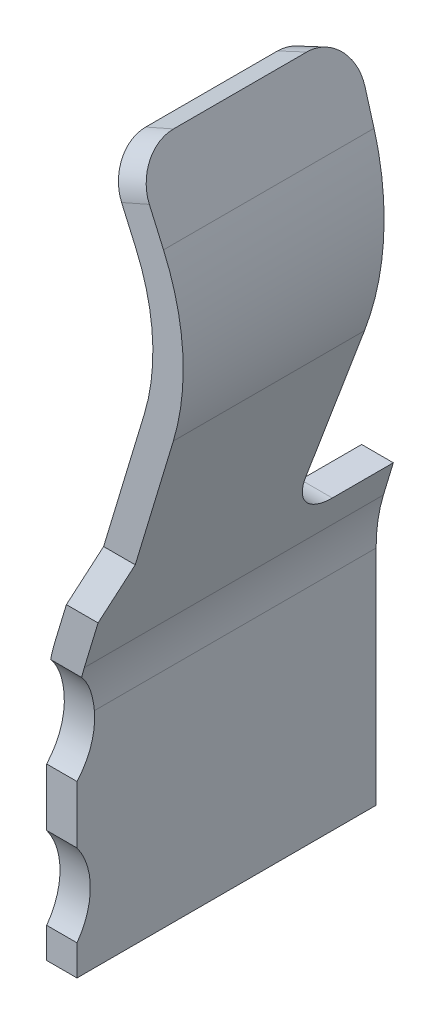
ISO-10303-21;
HEADER;
FILE_DESCRIPTION(('STEP AP214'),'2;1');
FILE_NAME('part.step','',(''),(''),'','','');
FILE_SCHEMA(('AUTOMOTIVE_DESIGN { 1 0 10303 214 1 1 1 1 }'));
ENDSEC;
DATA;
#1=APPLICATION_CONTEXT('core data for automotive mechanical design processes');
#2=APPLICATION_PROTOCOL_DEFINITION('international standard','automotive_design',2000,#1);
#3=PRODUCT_CONTEXT('',#1,'mechanical');
#4=PRODUCT('Part','Part','',(#3));
#5=PRODUCT_RELATED_PRODUCT_CATEGORY('part','',(#4));
#6=PRODUCT_DEFINITION_FORMATION('','',#4);
#7=PRODUCT_DEFINITION_CONTEXT('part definition',#1,'design');
#8=PRODUCT_DEFINITION('design','',#6,#7);
#9=PRODUCT_DEFINITION_SHAPE('','',#8);
#10=(LENGTH_UNIT() NAMED_UNIT(*) SI_UNIT(.MILLI.,.METRE.));
#11=(NAMED_UNIT(*) PLANE_ANGLE_UNIT() SI_UNIT($,.RADIAN.));
#12=(NAMED_UNIT(*) SI_UNIT($,.STERADIAN.) SOLID_ANGLE_UNIT());
#13=UNCERTAINTY_MEASURE_WITH_UNIT(LENGTH_MEASURE(1.E-05),#10,'distance_accuracy_value','');
#14=(GEOMETRIC_REPRESENTATION_CONTEXT(3) GLOBAL_UNCERTAINTY_ASSIGNED_CONTEXT((#13)) GLOBAL_UNIT_ASSIGNED_CONTEXT((#10,
#11,#12)) REPRESENTATION_CONTEXT('',''));
#15=CARTESIAN_POINT('',(0.,0.,0.));
#16=DIRECTION('',(0.,0.,1.));
#17=DIRECTION('',(1.,0.,0.));
#18=AXIS2_PLACEMENT_3D('',#15,#16,#17);
#19=CARTESIAN_POINT('',(-1.85613725867001,3.53312166947706,-0.236832722369338));
#20=DIRECTION('',(-0.914255270392898,-0.402239697454472,0.0483789866630426));
#21=DIRECTION('',(0.402711251685502,-0.915327071470027,0.));
#22=AXIS2_PLACEMENT_3D('',#19,#20,#21);
#23=CYLINDRICAL_SURFACE('',#22,0.2);
#24=CARTESIAN_POINT('',(-1.86964147732527,3.50329761180303,-0.434687053017797));
#25=CARTESIAN_POINT('',(-1.92071840447187,3.6193909515076,-0.448650066039084));
#26=CARTESIAN_POINT('',(-1.95898718351818,3.70637250294574,-0.363398989614743));
#27=CARTESIAN_POINT('',(-1.95898718351818,3.70637250294574,-0.235652283248446));
#28=(BOUNDED_CURVE() B_SPLINE_CURVE(3,(#24,#25,#26,#27),.UNSPECIFIED.,.F.,
.F.) B_SPLINE_CURVE_WITH_KNOTS((4,4),(3.0320715031167,4.71238898038462),
.UNSPECIFIED.) CURVE() GEOMETRIC_REPRESENTATION_ITEM() RATIONAL_B_SPLINE_CURVE((1.,
0.778229742533871,0.778229742533871,1.)) REPRESENTATION_ITEM(''));
#29=CARTESIAN_POINT('',(-1.86964147732527,3.50329761180303,-0.434687053017797));
#30=VERTEX_POINT('',#29);
#31=CARTESIAN_POINT('',(-1.95898718351818,3.70637250294574,-0.235652283248446));
#32=VERTEX_POINT('',#31);
#33=EDGE_CURVE('E288',#30,#32,#28,.T.);
#34=ORIENTED_EDGE('',*,*,#33,.F.);
#35=DIRECTION('',(0.914255270392898,0.402239697454473,-0.0483789866630426));
#36=VECTOR('',#35,1.);
#37=CARTESIAN_POINT('',(-25.917177596038,-7.07676024092296,0.837819069551529));
#38=LINE('',#37,#36);
#39=CARTESIAN_POINT('',(-2.00694053804578,3.44289092405021,-0.427421697659669));
#40=VERTEX_POINT('',#39);
#41=EDGE_CURVE('E11',#40,#30,#38,.T.);
#42=ORIENTED_EDGE('',*,*,#41,.F.);
#43=CARTESIAN_POINT('',(-2.09628624423868,3.64596581519291,-0.228386927890318));
#44=CARTESIAN_POINT('',(-2.09628624423869,3.64596581519291,-0.356133634256616));
#45=CARTESIAN_POINT('',(-2.05801746519237,3.55898426375477,-0.441384710680957));
#46=CARTESIAN_POINT('',(-2.00694053804578,3.44289092405021,-0.427421697659669));
#47=(BOUNDED_CURVE() B_SPLINE_CURVE(3,(#43,#44,#45,#46),.UNSPECIFIED.,.F.,
.F.) B_SPLINE_CURVE_WITH_KNOTS((4,4),(1.57079632679495,3.25111380406287),
.UNSPECIFIED.) CURVE() GEOMETRIC_REPRESENTATION_ITEM() RATIONAL_B_SPLINE_CURVE((1.,
0.778229742533869,0.778229742533869,1.)) REPRESENTATION_ITEM(''));
#48=CARTESIAN_POINT('',(-2.09628624423868,3.64596581519291,-0.228386927890318));
#49=VERTEX_POINT('',#48);
#50=EDGE_CURVE('E311',#49,#40,#47,.T.);
#51=ORIENTED_EDGE('',*,*,#50,.F.);
#52=DIRECTION('',(-0.914255270392898,-0.402239697454473,0.0483789866630426));
#53=VECTOR('',#52,1.);
#54=CARTESIAN_POINT('',(-1.93667950900712,3.71618708377106,-0.236832722369339));
#55=LINE('',#54,#53);
#56=EDGE_CURVE('E305',#32,#49,#55,.T.);
#57=ORIENTED_EDGE('',*,*,#56,.F.);
#58=EDGE_LOOP('',(#34,#42,#51,#57));
#59=FACE_BOUND('',#58,.T.);
#60=ADVANCED_FACE('F16',(#59),#23,.T.);
#61=CARTESIAN_POINT('',(-1.87844493318108,3.52330708865174,0.423604352914838));
#62=DIRECTION('',(0.915327071470027,0.402711251685503,0.));
#63=DIRECTION('',(-0.402711251685503,0.915327071470027,0.));
#64=AXIS2_PLACEMENT_3D('',#61,#62,#63);
#65=CYLINDRICAL_SURFACE('',#64,0.2);
#66=CARTESIAN_POINT('',(-2.01574399390158,3.46290040089891,0.423604352914837));
#67=DIRECTION('',(-0.915327071470027,-0.402711251685502,0.));
#68=DIRECTION('',(-0.402711251685502,0.915327071470027,0.));
#69=AXIS2_PLACEMENT_3D('',#66,#67,#68);
#70=CIRCLE('',#69,0.2);
#71=CARTESIAN_POINT('',(-2.01574399390159,3.46290040089891,0.623604352914837));
#72=VERTEX_POINT('',#71);
#73=CARTESIAN_POINT('',(-2.09628624423869,3.64596581519291,0.423604352914837));
#74=VERTEX_POINT('',#73);
#75=EDGE_CURVE('E318',#72,#74,#70,.T.);
#76=ORIENTED_EDGE('',*,*,#75,.F.);
#77=DIRECTION('',(-0.915327071470027,-0.402711251685503,0.));
#78=VECTOR('',#77,1.);
#79=CARTESIAN_POINT('',(-26.6330633966531,-7.36784176638169,0.623604352914803));
#80=LINE('',#79,#78);
#81=CARTESIAN_POINT('',(-1.87844493318108,3.52330708865174,0.623604352914837));
#82=VERTEX_POINT('',#81);
#83=EDGE_CURVE('E27',#82,#72,#80,.T.);
#84=ORIENTED_EDGE('',*,*,#83,.F.);
#85=CARTESIAN_POINT('',(-1.87844493318108,3.52330708865174,0.423604352914838));
#86=DIRECTION('',(0.915327071470028,0.402711251685501,0.));
#87=DIRECTION('',(0.402711251685501,-0.915327071470028,0.));
#88=AXIS2_PLACEMENT_3D('',#85,#86,#87);
#89=CIRCLE('',#88,0.2);
#90=CARTESIAN_POINT('',(-1.95898718351818,3.70637250294574,0.423604352914837));
#91=VERTEX_POINT('',#90);
#92=EDGE_CURVE('E271',#91,#82,#89,.T.);
#93=ORIENTED_EDGE('',*,*,#92,.F.);
#94=DIRECTION('',(0.915327071470027,0.402711251685503,0.));
#95=VECTOR('',#94,1.);
#96=CARTESIAN_POINT('',(-1.95898718351818,3.70637250294574,0.423604352914837));
#97=LINE('',#96,#95);
#98=EDGE_CURVE('E310',#74,#91,#97,.T.);
#99=ORIENTED_EDGE('',*,*,#98,.F.);
#100=EDGE_LOOP('',(#76,#84,#93,#99));
#101=FACE_BOUND('',#100,.T.);
#102=ADVANCED_FACE('F465',(#101),#65,.T.);
#103=CARTESIAN_POINT('',(-30.73,1.65634067151207,-0.212546111318104));
#104=DIRECTION('',(0.,-1.,0.));
#105=DIRECTION('',(0.,0.,-1.));
#106=AXIS2_PLACEMENT_3D('',#103,#104,#105);
#107=PLANE('',#106);
#108=DIRECTION('',(0.,0.,-1.));
#109=VECTOR('',#108,1.);
#110=CARTESIAN_POINT('',(-2.19150340910558,1.65634067151207,-0.740000000000021));
#111=LINE('',#110,#109);
#112=CARTESIAN_POINT('',(-2.19150340910558,1.65634067151207,-0.438042305987955));
#113=VERTEX_POINT('',#112);
#114=CARTESIAN_POINT('',(-2.19150340910558,1.65634067151207,-0.740000000000021));
#115=VERTEX_POINT('',#114);
#116=EDGE_CURVE('E244',#113,#115,#111,.T.);
#117=ORIENTED_EDGE('',*,*,#116,.F.);
#118=DIRECTION('',(1.,0.,0.));
#119=VECTOR('',#118,1.);
#120=CARTESIAN_POINT('',(-2.03483507894155,1.65634067151207,-0.438042305987954));
#121=LINE('',#120,#119);
#122=CARTESIAN_POINT('',(-2.03483507894154,1.65634067151207,-0.438042305987954));
#123=VERTEX_POINT('',#122);
#124=EDGE_CURVE('E245',#113,#123,#121,.T.);
#125=ORIENTED_EDGE('',*,*,#124,.T.);
#126=DIRECTION('',(0.,0.,1.));
#127=VECTOR('',#126,1.);
#128=CARTESIAN_POINT('',(-2.03483507894154,1.65634067151207,-0.74000000000002));
#129=LINE('',#128,#127);
#130=CARTESIAN_POINT('',(-2.03483507894154,1.65634067151207,-0.74000000000002));
#131=VERTEX_POINT('',#130);
#132=EDGE_CURVE('E238',#131,#123,#129,.T.);
#133=ORIENTED_EDGE('',*,*,#132,.F.);
#134=DIRECTION('',(-1.,0.,0.));
#135=VECTOR('',#134,1.);
#136=CARTESIAN_POINT('',(-1.27,1.65634067151207,-0.740000000000019));
#137=LINE('',#136,#135);
#138=EDGE_CURVE('E277',#131,#115,#137,.T.);
#139=ORIENTED_EDGE('',*,*,#138,.T.);
#140=EDGE_LOOP('',(#117,#125,#133,#139));
#141=FACE_BOUND('',#140,.T.);
#142=ADVANCED_FACE('F468',(#141),#107,.F.);
#143=CARTESIAN_POINT('',(-30.73,3.70637250294571,-0.459111687165995));
#144=DIRECTION('',(0.,0.119413416546905,0.992844618230162));
#145=DIRECTION('',(1.,0.,0.));
#146=AXIS2_PLACEMENT_3D('',#143,#144,#145);
#147=PLANE('',#146);
#148=DIRECTION('',(0.286748539926818,0.951150986717315,-0.11439875574724));
#149=VECTOR('',#148,1.);
#150=CARTESIAN_POINT('',(-2.06587763511194,1.55337185451571,-0.200161637444148));
#151=LINE('',#150,#149);
#152=CARTESIAN_POINT('',(-1.96733997726959,1.88022335482146,-0.239473382341922));
#153=VERTEX_POINT('',#152);
#154=CARTESIAN_POINT('',(-1.75979823954622,2.56864369924933,-0.322272466749581));
#155=VERTEX_POINT('',#154);
#156=EDGE_CURVE('E234',#153,#155,#151,.T.);
#157=ORIENTED_EDGE('',*,*,#156,.F.);
#158=DIRECTION('',(-1.,0.,0.));
#159=VECTOR('',#158,1.);
#160=CARTESIAN_POINT('',(-2.19150340910559,1.88022335482146,-0.239473382341922));
#161=LINE('',#160,#159);
#162=CARTESIAN_POINT('',(-2.12400830743362,1.88022335482146,-0.239473382341922));
#163=VERTEX_POINT('',#162);
#164=EDGE_CURVE('E360',#153,#163,#161,.T.);
#165=ORIENTED_EDGE('',*,*,#164,.T.);
#166=DIRECTION('',(-0.28674853992682,-0.951150986717314,0.11439875574724));
#167=VECTOR('',#166,1.);
#168=CARTESIAN_POINT('',(-2.2096639548885,1.59610175610151,-0.205300934614505));
#169=LINE('',#168,#167);
#170=CARTESIAN_POINT('',(-1.90341373590366,2.61194022573825,-0.327479914176623));
#171=VERTEX_POINT('',#170);
#172=EDGE_CURVE('E264',#171,#163,#169,.T.);
#173=ORIENTED_EDGE('',*,*,#172,.F.);
#174=CARTESIAN_POINT('',(-1.94552330681659,3.30329498734983,-0.410631932744419));
#175=CARTESIAN_POINT('',(-1.8485450102924,3.08287189317973,-0.384120760424612));
#176=CARTESIAN_POINT('',(-1.83390448882343,2.84250387207174,-0.355210731501567));
#177=CARTESIAN_POINT('',(-1.90341373590366,2.61194022573825,-0.327479914176623));
#178=(BOUNDED_CURVE() B_SPLINE_CURVE(3,(#174,#175,#176,#177),.UNSPECIFIED.,.F.,
.F.) B_SPLINE_CURVE_WITH_KNOTS((4,4),(4.29791199977039,5.00519872138853),
.UNSPECIFIED.) CURVE() GEOMETRIC_REPRESENTATION_ITEM() RATIONAL_B_SPLINE_CURVE((1.,
0.958744787021091,0.958744787021091,1.)) REPRESENTATION_ITEM(''));
#179=CARTESIAN_POINT('',(-1.94552330681659,3.30329498734983,-0.410631932744419));
#180=VERTEX_POINT('',#179);
#181=EDGE_CURVE('E373',#180,#171,#178,.T.);
#182=ORIENTED_EDGE('',*,*,#181,.F.);
#183=DIRECTION('',(0.400292818236851,-0.909830186054405,0.109428936813833));
#184=VECTOR('',#183,1.);
#185=CARTESIAN_POINT('',(-1.95995081965593,3.33608744850051,-0.414576013974334));
#186=LINE('',#185,#184);
#187=EDGE_CURVE('E317',#40,#180,#186,.T.);
#188=ORIENTED_EDGE('',*,*,#187,.F.);
#189=ORIENTED_EDGE('',*,*,#41,.T.);
#190=DIRECTION('',(-0.40029281823685,0.909830186054405,-0.109428936813833));
#191=VECTOR('',#190,1.);
#192=CARTESIAN_POINT('',(-1.82233351008822,3.39577078475993,-0.421754368938235));
#193=LINE('',#192,#191);
#194=CARTESIAN_POINT('',(-1.80822424609609,3.36370167510267,-0.417897288102547));
#195=VERTEX_POINT('',#194);
#196=EDGE_CURVE('E298',#195,#30,#193,.T.);
#197=ORIENTED_EDGE('',*,*,#196,.F.);
#198=CARTESIAN_POINT('',(-1.75979823954622,2.56864369924933,-0.322272466749581));
#199=CARTESIAN_POINT('',(-1.67986260540396,2.83379189253285,-0.354162906673267));
#200=CARTESIAN_POINT('',(-1.69669920509327,3.11021511680704,-0.387409439934769));
#201=CARTESIAN_POINT('',(-1.80822424609609,3.36370167510267,-0.417897288102547));
#202=(BOUNDED_CURVE() B_SPLINE_CURVE(3,(#198,#199,#200,#201),.UNSPECIFIED.,.F.,
.F.) B_SPLINE_CURVE_WITH_KNOTS((4,4),(1.27798658579106,1.98527330740919),
.UNSPECIFIED.) CURVE() GEOMETRIC_REPRESENTATION_ITEM() RATIONAL_B_SPLINE_CURVE((1.,
0.958744787021091,0.958744787021091,1.)) REPRESENTATION_ITEM(''));
#203=EDGE_CURVE('E398',#155,#195,#202,.T.);
#204=ORIENTED_EDGE('',*,*,#203,.F.);
#205=EDGE_LOOP('',(#157,#165,#173,#182,#188,#189,#197,#204));
#206=FACE_BOUND('',#205,.T.);
#207=ADVANCED_FACE('F491',(#206),#147,.F.);
#208=CARTESIAN_POINT('',(-30.73,1.94413292378283,0.623604352914797));
#209=DIRECTION('',(0.,0.,-1.));
#210=DIRECTION('',(0.,-1.,0.));
#211=AXIS2_PLACEMENT_3D('',#208,#209,#210);
#212=PLANE('',#211);
#213=DIRECTION('',(0.4027112516855,-0.915327071470028,0.));
#214=VECTOR('',#213,1.);
#215=CARTESIAN_POINT('',(-1.80822424609609,3.36370167510267,0.623604352914838));
#216=LINE('',#215,#214);
#217=CARTESIAN_POINT('',(-1.80822424609609,3.36370167510267,0.623604352914838));
#218=VERTEX_POINT('',#217);
#219=EDGE_CURVE('E275',#82,#218,#216,.T.);
#220=ORIENTED_EDGE('',*,*,#219,.F.);
#221=ORIENTED_EDGE('',*,*,#83,.T.);
#222=DIRECTION('',(-0.402711251685501,0.915327071470028,0.));
#223=VECTOR('',#222,1.);
#224=CARTESIAN_POINT('',(-1.94552330681659,3.30329498734984,0.623604352914837));
#225=LINE('',#224,#223);
#226=CARTESIAN_POINT('',(-1.94552330681659,3.30329498734983,0.623604352914837));
#227=VERTEX_POINT('',#226);
#228=EDGE_CURVE('E309',#227,#72,#225,.T.);
#229=ORIENTED_EDGE('',*,*,#228,.F.);
#230=CARTESIAN_POINT('',(-2.86085037828662,2.90058373566433,0.623604352914836));
#231=DIRECTION('',(0.,0.,1.));
#232=DIRECTION('',(-1.,0.,0.));
#233=AXIS2_PLACEMENT_3D('',#230,#231,#232);
#234=CIRCLE('',#233,1.);
#235=CARTESIAN_POINT('',(-1.90341373590366,2.61194022573825,0.623604352914837));
#236=VERTEX_POINT('',#235);
#237=EDGE_CURVE('E335',#236,#227,#234,.T.);
#238=ORIENTED_EDGE('',*,*,#237,.F.);
#239=DIRECTION('',(0.28864350992609,0.957436642382956,0.));
#240=VECTOR('',#239,1.);
#241=CARTESIAN_POINT('',(-2.22743664238296,1.53714937485737,0.623604352914836));
#242=LINE('',#241,#240);
#243=CARTESIAN_POINT('',(-2.10474115022836,1.94413292378283,0.623604352914837));
#244=VERTEX_POINT('',#243);
#245=EDGE_CURVE('E251',#244,#236,#242,.T.);
#246=ORIENTED_EDGE('',*,*,#245,.F.);
#247=DIRECTION('',(1.,0.,0.));
#248=VECTOR('',#247,1.);
#249=CARTESIAN_POINT('',(-30.73,1.94413292378283,0.623604352914797));
#250=LINE('',#249,#248);
#251=CARTESIAN_POINT('',(-1.94807282006433,1.94413292378283,0.623604352914837));
#252=VERTEX_POINT('',#251);
#253=EDGE_CURVE('E281',#244,#252,#250,.T.);
#254=ORIENTED_EDGE('',*,*,#253,.T.);
#255=DIRECTION('',(-0.288643509926088,-0.957436642382956,0.));
#256=VECTOR('',#255,1.);
#257=CARTESIAN_POINT('',(-2.08382114602552,1.49385284836845,0.623604352914837));
#258=LINE('',#257,#256);
#259=CARTESIAN_POINT('',(-1.75979823954622,2.56864369924933,0.623604352914837));
#260=VERTEX_POINT('',#259);
#261=EDGE_CURVE('E228',#260,#252,#258,.T.);
#262=ORIENTED_EDGE('',*,*,#261,.F.);
#263=CARTESIAN_POINT('',(-2.86085037828662,2.90058373566433,0.623604352914836));
#264=DIRECTION('',(0.,0.,-1.));
#265=DIRECTION('',(-1.,0.,0.));
#266=AXIS2_PLACEMENT_3D('',#263,#264,#265);
#267=CIRCLE('',#266,1.15);
#268=EDGE_CURVE('E325',#218,#260,#267,.T.);
#269=ORIENTED_EDGE('',*,*,#268,.F.);
#270=EDGE_LOOP('',(#220,#221,#229,#238,#246,#254,#262,#269));
#271=FACE_BOUND('',#270,.T.);
#272=ADVANCED_FACE('F622',(#271),#212,.F.);
#273=CARTESIAN_POINT('',(-30.73,1.7003498353216,0.749999999999972));
#274=DIRECTION('',(0.,-0.460287319631494,-0.887770005906065));
#275=DIRECTION('',(0.,-0.887770005906065,0.460287319631494));
#276=AXIS2_PLACEMENT_3D('',#273,#274,#275);
#277=PLANE('',#276);
#278=ORIENTED_EDGE('',*,*,#253,.F.);
#279=DIRECTION('',(0.258541028225373,0.857586072334425,-0.444637678635293));
#280=VECTOR('',#279,1.);
#281=CARTESIAN_POINT('',(-2.04642343830644,2.13757401070795,0.523309818502746));
#282=LINE('',#281,#280);
#283=CARTESIAN_POINT('',(-2.17242108767926,1.7196371362757,0.73999999999998));
#284=VERTEX_POINT('',#283);
#285=EDGE_CURVE('E256',#284,#244,#282,.T.);
#286=ORIENTED_EDGE('',*,*,#285,.F.);
#287=DIRECTION('',(-1.,0.,0.));
#288=VECTOR('',#287,1.);
#289=CARTESIAN_POINT('',(-1.27,1.7196371362757,0.739999999999981));
#290=LINE('',#289,#288);
#291=CARTESIAN_POINT('',(-2.01575275751523,1.7196371362757,0.73999999999998));
#292=VERTEX_POINT('',#291);
#293=EDGE_CURVE('E392',#292,#284,#290,.T.);
#294=ORIENTED_EDGE('',*,*,#293,.F.);
#295=DIRECTION('',(-0.258541028225372,-0.857586072334425,0.444637678635293));
#296=VECTOR('',#295,1.);
#297=CARTESIAN_POINT('',(-1.90022736191621,2.10283732290249,0.541319952677682));
#298=LINE('',#297,#296);
#299=EDGE_CURVE('E231',#252,#292,#298,.T.);
#300=ORIENTED_EDGE('',*,*,#299,.F.);
#301=EDGE_LOOP('',(#278,#286,#294,#300));
#302=FACE_BOUND('',#301,.T.);
#303=ADVANCED_FACE('F18',(#302),#277,.F.);
#304=CARTESIAN_POINT('',(-1.27,1.24850586493128,0.739999999999981));
#305=DIRECTION('',(0.,0.,-1.));
#306=DIRECTION('',(0.,-1.,0.));
#307=AXIS2_PLACEMENT_3D('',#304,#305,#306);
#308=PLANE('',#307);
#309=DIRECTION('',(0.,1.,0.));
#310=VECTOR('',#309,1.);
#311=CARTESIAN_POINT('',(-2.12,0.145965815192914,0.73999999999998));
#312=LINE('',#311,#310);
#313=CARTESIAN_POINT('',(-2.12,0.145965815192914,0.73999999999998));
#314=VERTEX_POINT('',#313);
#315=CARTESIAN_POINT('',(-2.12,0.296740599868486,0.73999999999998));
#316=VERTEX_POINT('',#315);
#317=EDGE_CURVE('E168',#314,#316,#312,.T.);
#318=ORIENTED_EDGE('',*,*,#317,.T.);
#319=DIRECTION('',(-1.,0.,0.));
#320=VECTOR('',#319,1.);
#321=CARTESIAN_POINT('',(-30.73,0.296740599868486,0.73999999999994));
#322=LINE('',#321,#320);
#323=CARTESIAN_POINT('',(-2.27,0.296740599868486,0.739999999999979));
#324=VERTEX_POINT('',#323);
#325=EDGE_CURVE('E217',#316,#324,#322,.T.);
#326=ORIENTED_EDGE('',*,*,#325,.T.);
#327=DIRECTION('',(0.,-1.,0.));
#328=VECTOR('',#327,1.);
#329=CARTESIAN_POINT('',(-2.27,0.145965815192914,0.739999999999979));
#330=LINE('',#329,#328);
#331=CARTESIAN_POINT('',(-2.27,0.145965815192914,0.739999999999979));
#332=VERTEX_POINT('',#331);
#333=EDGE_CURVE('E195',#324,#332,#330,.T.);
#334=ORIENTED_EDGE('',*,*,#333,.T.);
#335=DIRECTION('',(1.,0.,0.));
#336=VECTOR('',#335,1.);
#337=CARTESIAN_POINT('',(-2.12,0.145965815192914,0.73999999999998));
#338=LINE('',#337,#336);
#339=EDGE_CURVE('E190',#332,#314,#338,.T.);
#340=ORIENTED_EDGE('',*,*,#339,.T.);
#341=EDGE_LOOP('',(#318,#326,#334,#340));
#342=FACE_BOUND('',#341,.T.);
#343=ADVANCED_FACE('F194',(#342),#308,.F.);
#344=CARTESIAN_POINT('',(-1.27,1.24850586493128,-0.740000000000019));
#345=DIRECTION('',(0.,0.,-1.));
#346=DIRECTION('',(0.,-1.,0.));
#347=AXIS2_PLACEMENT_3D('',#344,#345,#346);
#348=PLANE('',#347);
#349=ORIENTED_EDGE('',*,*,#138,.F.);
#350=DIRECTION('',(0.288643509926088,0.957436642382956,0.));
#351=VECTOR('',#350,1.);
#352=CARTESIAN_POINT('',(-2.08382114602552,1.49385284836845,-0.74000000000002));
#353=LINE('',#352,#351);
#354=CARTESIAN_POINT('',(-2.08382114602552,1.49385284836845,-0.74000000000002));
#355=VERTEX_POINT('',#354);
#356=EDGE_CURVE('E260',#355,#131,#353,.T.);
#357=ORIENTED_EDGE('',*,*,#356,.F.);
#358=CARTESIAN_POINT('',(-1.27,1.24850586493128,-0.740000000000019));
#359=DIRECTION('',(0.,0.,-1.));
#360=DIRECTION('',(1.,0.,0.));
#361=AXIS2_PLACEMENT_3D('',#358,#359,#360);
#362=CIRCLE('',#361,0.85);
#363=CARTESIAN_POINT('',(-2.12,1.24850586493128,-0.74000000000002));
#364=VERTEX_POINT('',#363);
#365=EDGE_CURVE('E223',#364,#355,#362,.T.);
#366=ORIENTED_EDGE('',*,*,#365,.F.);
#367=DIRECTION('',(0.,1.,0.));
#368=VECTOR('',#367,1.);
#369=CARTESIAN_POINT('',(-2.12,0.145965815192914,-0.74000000000002));
#370=LINE('',#369,#368);
#371=CARTESIAN_POINT('',(-2.12,0.145965815192914,-0.74000000000002));
#372=VERTEX_POINT('',#371);
#373=EDGE_CURVE('E183',#372,#364,#370,.T.);
#374=ORIENTED_EDGE('',*,*,#373,.F.);
#375=DIRECTION('',(1.,0.,0.));
#376=VECTOR('',#375,1.);
#377=CARTESIAN_POINT('',(-2.12,0.145965815192914,-0.74000000000002));
#378=LINE('',#377,#376);
#379=CARTESIAN_POINT('',(-2.27,0.145965815192914,-0.740000000000021));
#380=VERTEX_POINT('',#379);
#381=EDGE_CURVE('E191',#380,#372,#378,.T.);
#382=ORIENTED_EDGE('',*,*,#381,.F.);
#383=DIRECTION('',(0.,-1.,0.));
#384=VECTOR('',#383,1.);
#385=CARTESIAN_POINT('',(-2.27,0.145965815192914,-0.740000000000021));
#386=LINE('',#385,#384);
#387=CARTESIAN_POINT('',(-2.27,1.24850586493128,-0.740000000000021));
#388=VERTEX_POINT('',#387);
#389=EDGE_CURVE('E42',#388,#380,#386,.T.);
#390=ORIENTED_EDGE('',*,*,#389,.F.);
#391=CARTESIAN_POINT('',(-1.27,1.24850586493128,-0.740000000000019));
#392=DIRECTION('',(0.,0.,1.));
#393=DIRECTION('',(1.,0.,0.));
#394=AXIS2_PLACEMENT_3D('',#391,#392,#393);
#395=CIRCLE('',#394,1.);
#396=CARTESIAN_POINT('',(-2.22743664238295,1.53714937485737,-0.740000000000021));
#397=VERTEX_POINT('',#396);
#398=EDGE_CURVE('E357',#397,#388,#395,.T.);
#399=ORIENTED_EDGE('',*,*,#398,.F.);
#400=DIRECTION('',(-0.28864350992609,-0.957436642382956,0.));
#401=VECTOR('',#400,1.);
#402=CARTESIAN_POINT('',(-2.22743664238295,1.53714937485737,-0.740000000000021));
#403=LINE('',#402,#401);
#404=EDGE_CURVE('E239',#115,#397,#403,.T.);
#405=ORIENTED_EDGE('',*,*,#404,.F.);
#406=EDGE_LOOP('',(#349,#357,#366,#374,#382,#390,#399,#405));
#407=FACE_BOUND('',#406,.T.);
#408=ADVANCED_FACE('F483',(#407),#348,.T.);
#409=CARTESIAN_POINT('',(-2.27,0.145965815192914,-0.740000000000021));
#410=DIRECTION('',(1.,0.,0.));
#411=DIRECTION('',(0.,1.,0.));
#412=AXIS2_PLACEMENT_3D('',#409,#410,#411);
#413=PLANE('',#412);
#414=DIRECTION('',(0.,-1.,0.));
#415=VECTOR('',#414,1.);
#416=CARTESIAN_POINT('',(-2.27,0.145965815192914,0.739999999999979));
#417=LINE('',#416,#415);
#418=CARTESIAN_POINT('',(-2.27,0.988055123608201,0.739999999999979));
#419=VERTEX_POINT('',#418);
#420=CARTESIAN_POINT('',(-2.27,0.703259400131467,0.739999999999979));
#421=VERTEX_POINT('',#420);
#422=EDGE_CURVE('E199',#419,#421,#417,.T.);
#423=ORIENTED_EDGE('',*,*,#422,.F.);
#424=CARTESIAN_POINT('',(-2.27,1.21669179396546,0.995153761033096));
#425=DIRECTION('',(1.,0.,0.));
#426=DIRECTION('',(0.,1.,0.));
#427=AXIS2_PLACEMENT_3D('',#424,#425,#426);
#428=CIRCLE('',#427,0.342604974863759);
#429=CARTESIAN_POINT('',(-2.27,1.24850586493128,0.654029100989324));
#430=VERTEX_POINT('',#429);
#431=EDGE_CURVE('E349',#419,#430,#428,.T.);
#432=ORIENTED_EDGE('',*,*,#431,.T.);
#433=DIRECTION('',(0.,0.,1.));
#434=VECTOR('',#433,1.);
#435=CARTESIAN_POINT('',(-2.27,1.24850586493128,-0.740000000000021));
#436=LINE('',#435,#434);
#437=EDGE_CURVE('E255',#388,#430,#436,.T.);
#438=ORIENTED_EDGE('',*,*,#437,.F.);
#439=ORIENTED_EDGE('',*,*,#389,.T.);
#440=DIRECTION('',(0.,0.,1.));
#441=VECTOR('',#440,1.);
#442=CARTESIAN_POINT('',(-2.27,0.145965815192914,-0.740000000000021));
#443=LINE('',#442,#441);
#444=EDGE_CURVE('E198',#380,#332,#443,.T.);
#445=ORIENTED_EDGE('',*,*,#444,.T.);
#446=ORIENTED_EDGE('',*,*,#333,.F.);
#447=CARTESIAN_POINT('',(-2.27,0.499999999999977,1.0194268345702));
#448=DIRECTION('',(1.,0.,0.));
#449=DIRECTION('',(0.,1.,0.));
#450=AXIS2_PLACEMENT_3D('',#447,#448,#449);
#451=CIRCLE('',#450,0.345533991988848);
#452=EDGE_CURVE('E214',#324,#421,#451,.T.);
#453=ORIENTED_EDGE('',*,*,#452,.T.);
#454=EDGE_LOOP('',(#423,#432,#438,#439,#445,#446,#453));
#455=FACE_BOUND('',#454,.T.);
#456=ADVANCED_FACE('F451',(#455),#413,.F.);
#457=CARTESIAN_POINT('',(-1.27,1.24850586493128,-0.740000000000019));
#458=DIRECTION('',(0.,0.,1.));
#459=DIRECTION('',(-1.,0.,0.));
#460=AXIS2_PLACEMENT_3D('',#457,#458,#459);
#461=CYLINDRICAL_SURFACE('',#460,1.);
#462=ORIENTED_EDGE('',*,*,#437,.T.);
#463=CARTESIAN_POINT('',(-2.27,1.24850586493127,0.654029100989324));
#464=CARTESIAN_POINT('',(-2.27000007407363,1.25306932177748,0.654454497923835));
#465=CARTESIAN_POINT('',(-2.26996876472137,1.25762446546712,0.654969794425774));
#466=CARTESIAN_POINT('',(-2.26984483490432,1.26669234380872,0.656178662703507));
#467=CARTESIAN_POINT('',(-2.26975245079703,1.27120517419842,0.656871540938563));
#468=CARTESIAN_POINT('',(-2.26950808670678,1.28018764830056,0.658435530000101));
#469=CARTESIAN_POINT('',(-2.26935624289613,1.28465736694881,0.659306231418194));
#470=CARTESIAN_POINT('',(-2.26899477703104,1.29355289226453,0.661225514697385));
#471=CARTESIAN_POINT('',(-2.2687851944591,1.29797872680563,0.66227397481712));
#472=CARTESIAN_POINT('',(-2.26831002792707,1.30678583476397,0.664548502475786));
#473=CARTESIAN_POINT('',(-2.26804439252603,1.31116706334694,0.665774732832754));
#474=CARTESIAN_POINT('',(-2.26745889152881,1.31988437499395,0.668404514864849));
#475=CARTESIAN_POINT('',(-2.26713889099457,1.32422031651338,0.669808505488944));
#476=CARTESIAN_POINT('',(-2.26644641069623,1.33284654509273,0.672793524574298));
#477=CARTESIAN_POINT('',(-2.26607372137307,1.33713657245114,0.67437525453736));
#478=CARTESIAN_POINT('',(-2.26527760241854,1.34567049059148,0.677715533217567));
#479=CARTESIAN_POINT('',(-2.26485389867301,1.34991398511754,0.679475028174295));
#480=CARTESIAN_POINT('',(-2.26396321849389,1.35830019523904,0.683146652073494));
#481=CARTESIAN_POINT('',(-2.26349650719558,1.36244335249443,0.685057836907499));
#482=CARTESIAN_POINT('',(-2.26252312860201,1.37063194178074,0.6890335315101));
#483=CARTESIAN_POINT('',(-2.26201661211662,1.3746776733665,0.691097460992356));
#484=CARTESIAN_POINT('',(-2.26096713168236,1.38267128376232,0.695378434355305));
#485=CARTESIAN_POINT('',(-2.26042424735263,1.3866193519919,0.69759514404689));
#486=CARTESIAN_POINT('',(-2.25930544298223,1.39441764648526,0.702181418874191));
#487=CARTESIAN_POINT('',(-2.25872954299439,1.39826793013232,0.704550891332612));
#488=CARTESIAN_POINT('',(-2.25754802962805,1.40587073759695,0.709442454924467));
#489=CARTESIAN_POINT('',(-2.25694238918284,1.40962316741917,0.711964685588729));
#490=CARTESIAN_POINT('',(-2.25570462073635,1.4170304504751,0.717161525963165));
#491=CARTESIAN_POINT('',(-2.25507243147301,1.42068504210779,0.719836493879691));
#492=CARTESIAN_POINT('',(-2.25378470654221,1.42789683764576,0.725338623347788));
#493=CARTESIAN_POINT('',(-2.25312908847075,1.43145359950846,0.728166344681211));
#494=CARTESIAN_POINT('',(-2.25179751594577,1.43847023752972,0.733973670299352));
#495=CARTESIAN_POINT('',(-2.25112147050097,1.44192948379825,0.736954014976151));
#496=CARTESIAN_POINT('',(-2.25043911813473,1.44532846432271,0.73999999999998));
#497=B_SPLINE_CURVE_WITH_KNOTS('',3,(#463,#464,#465,#466,#467,#468,#469,#470,#471,#472,#473,
#474,#475,#476,#477,#478,#479,#480,#481,#482,#483,#484,#485,#486,#487,#488,#489,#490,#491,#492,
#493,#494,#495,#496),.UNSPECIFIED.,.F.,.F.,(4,2,2,2,2,2,2,2,2,2,2,2,2,2,2,2,4),(0.,
0.013748827736232,0.0274447569667543,0.0411095020469267,0.0547649260984996,0.0684329369744623,
0.0821353821572885,0.0958939450956067,0.109730045405059,0.123485924962941,0.137191991355335,
0.150868974599205,0.164537737053089,0.17821917870054,0.191934141578145,0.205703315519925,
0.219547147320743),.UNSPECIFIED.);
#498=CARTESIAN_POINT('',(-2.25043911813473,1.44532846432271,0.739999999999979));
#499=VERTEX_POINT('',#498);
#500=EDGE_CURVE('E218',#430,#499,#497,.T.);
#501=ORIENTED_EDGE('',*,*,#500,.T.);
#502=CARTESIAN_POINT('',(-1.27,1.24850586493128,0.739999999999981));
#503=DIRECTION('',(0.,0.,1.));
#504=DIRECTION('',(1.,0.,0.));
#505=AXIS2_PLACEMENT_3D('',#502,#503,#504);
#506=CIRCLE('',#505,1.);
#507=CARTESIAN_POINT('',(-2.22743664238295,1.53714937485737,0.739999999999979));
#508=VERTEX_POINT('',#507);
#509=EDGE_CURVE('E405',#508,#499,#506,.T.);
#510=ORIENTED_EDGE('',*,*,#509,.F.);
#511=DIRECTION('',(0.,0.,1.));
#512=VECTOR('',#511,1.);
#513=CARTESIAN_POINT('',(-2.22743664238295,1.53714937485737,-0.740000000000021));
#514=LINE('',#513,#512);
#515=EDGE_CURVE('E243',#397,#508,#514,.T.);
#516=ORIENTED_EDGE('',*,*,#515,.F.);
#517=ORIENTED_EDGE('',*,*,#398,.T.);
#518=EDGE_LOOP('',(#462,#501,#510,#516,#517));
#519=FACE_BOUND('',#518,.T.);
#520=ADVANCED_FACE('F440',(#519),#461,.T.);
#521=CARTESIAN_POINT('',(-2.22743664238295,1.53714937485737,-0.740000000000021));
#522=DIRECTION('',(0.957436642382956,-0.28864350992609,0.));
#523=DIRECTION('',(0.,0.,-1.));
#524=AXIS2_PLACEMENT_3D('',#521,#522,#523);
#525=PLANE('',#524);
#526=ORIENTED_EDGE('',*,*,#172,.T.);
#527=CARTESIAN_POINT('',(-2.12400830743362,1.88022335482146,-0.239473382341922));
#528=CARTESIAN_POINT('',(-2.12639827429865,1.87229578405696,-0.238519901512672));
#529=CARTESIAN_POINT('',(-2.12880115558452,1.86432537588468,-0.238042305987954));
#530=CARTESIAN_POINT('',(-2.13120834682183,1.85634067151208,-0.238042305987954));
#531=(BOUNDED_CURVE() B_SPLINE_CURVE(3,(#527,#528,#529,#530),.UNSPECIFIED.,.F.,
.F.) B_SPLINE_CURVE_WITH_KNOTS((4,4),(4.59268992994791,4.71238898038469),
.UNSPECIFIED.) CURVE() GEOMETRIC_REPRESENTATION_ITEM() RATIONAL_B_SPLINE_CURVE((1.,
0.998806367803328,0.998806367803328,1.)) REPRESENTATION_ITEM(''));
#532=CARTESIAN_POINT('',(-2.13120834682183,1.85634067151208,-0.238042305987954));
#533=VERTEX_POINT('',#532);
#534=EDGE_CURVE('E287',#163,#533,#531,.T.);
#535=ORIENTED_EDGE('',*,*,#534,.T.);
#536=CARTESIAN_POINT('',(-2.13120834682183,1.85634067151208,-0.238042305987954));
#537=CARTESIAN_POINT('',(-2.16652837656352,1.73918338398669,-0.238042305987954));
#538=CARTESIAN_POINT('',(-2.19150340910557,1.65634067151208,-0.320885018462573));
#539=CARTESIAN_POINT('',(-2.19150340910558,1.65634067151207,-0.438042305987955));
#540=(BOUNDED_CURVE() B_SPLINE_CURVE(3,(#536,#537,#538,#539),.UNSPECIFIED.,.F.,
.F.) B_SPLINE_CURVE_WITH_KNOTS((4,4),(4.71238898038469,6.28318530717959),
.UNSPECIFIED.) CURVE() GEOMETRIC_REPRESENTATION_ITEM() RATIONAL_B_SPLINE_CURVE((1.,
0.804737854124365,0.804737854124365,1.)) REPRESENTATION_ITEM(''));
#541=EDGE_CURVE('E249',#533,#113,#540,.T.);
#542=ORIENTED_EDGE('',*,*,#541,.T.);
#543=ORIENTED_EDGE('',*,*,#116,.T.);
#544=ORIENTED_EDGE('',*,*,#404,.T.);
#545=ORIENTED_EDGE('',*,*,#515,.T.);
#546=DIRECTION('',(-0.28864350992609,-0.957436642382956,0.));
#547=VECTOR('',#546,1.);
#548=CARTESIAN_POINT('',(-2.22743664238296,1.53714937485737,0.739999999999979));
#549=LINE('',#548,#547);
#550=EDGE_CURVE('E401',#284,#508,#549,.T.);
#551=ORIENTED_EDGE('',*,*,#550,.F.);
#552=ORIENTED_EDGE('',*,*,#285,.T.);
#553=ORIENTED_EDGE('',*,*,#245,.T.);
#554=DIRECTION('',(0.,0.,1.));
#555=VECTOR('',#554,1.);
#556=CARTESIAN_POINT('',(-1.90341373590366,2.61194022573825,-0.74000000000002));
#557=LINE('',#556,#555);
#558=EDGE_CURVE('E341',#171,#236,#557,.T.);
#559=ORIENTED_EDGE('',*,*,#558,.F.);
#560=EDGE_LOOP('',(#526,#535,#542,#543,#544,#545,#551,#552,#553,#559));
#561=FACE_BOUND('',#560,.T.);
#562=ADVANCED_FACE('F450',(#561),#525,.F.);
#563=CARTESIAN_POINT('',(-2.86085037828662,2.90058373566433,-0.740000000000021));
#564=DIRECTION('',(0.,0.,1.));
#565=DIRECTION('',(-1.,0.,0.));
#566=AXIS2_PLACEMENT_3D('',#563,#564,#565);
#567=CYLINDRICAL_SURFACE('',#566,1.);
#568=DIRECTION('',(0.,0.,1.));
#569=VECTOR('',#568,1.);
#570=CARTESIAN_POINT('',(-1.94552330681659,3.30329498734983,-0.74000000000002));
#571=LINE('',#570,#569);
#572=EDGE_CURVE('E370',#180,#227,#571,.T.);
#573=ORIENTED_EDGE('',*,*,#572,.F.);
#574=ORIENTED_EDGE('',*,*,#181,.T.);
#575=ORIENTED_EDGE('',*,*,#558,.T.);
#576=ORIENTED_EDGE('',*,*,#237,.T.);
#577=EDGE_LOOP('',(#573,#574,#575,#576));
#578=FACE_BOUND('',#577,.T.);
#579=ADVANCED_FACE('F461',(#578),#567,.F.);
#580=CARTESIAN_POINT('',(-1.94552330681659,3.30329498734984,-0.74000000000002));
#581=DIRECTION('',(0.915327071470028,0.402711251685501,0.));
#582=DIRECTION('',(0.,0.,-1.));
#583=AXIS2_PLACEMENT_3D('',#580,#581,#582);
#584=PLANE('',#583);
#585=ORIENTED_EDGE('',*,*,#228,.T.);
#586=ORIENTED_EDGE('',*,*,#75,.T.);
#587=DIRECTION('',(0.,0.,1.));
#588=VECTOR('',#587,1.);
#589=CARTESIAN_POINT('',(-2.09628624423868,3.64596581519291,-0.740000000000021));
#590=LINE('',#589,#588);
#591=EDGE_CURVE('E297',#49,#74,#590,.T.);
#592=ORIENTED_EDGE('',*,*,#591,.F.);
#593=ORIENTED_EDGE('',*,*,#50,.T.);
#594=ORIENTED_EDGE('',*,*,#187,.T.);
#595=ORIENTED_EDGE('',*,*,#572,.T.);
#596=EDGE_LOOP('',(#585,#586,#592,#593,#594,#595));
#597=FACE_BOUND('',#596,.T.);
#598=ADVANCED_FACE('F585',(#597),#584,.F.);
#599=CARTESIAN_POINT('',(-1.95898718351818,3.70637250294574,-0.74000000000002));
#600=DIRECTION('',(0.402711251685503,-0.915327071470027,0.));
#601=DIRECTION('',(0.,0.,-1.));
#602=AXIS2_PLACEMENT_3D('',#599,#600,#601);
#603=PLANE('',#602);
#604=ORIENTED_EDGE('',*,*,#591,.T.);
#605=ORIENTED_EDGE('',*,*,#98,.T.);
#606=DIRECTION('',(0.,0.,1.));
#607=VECTOR('',#606,1.);
#608=CARTESIAN_POINT('',(-1.95898718351818,3.70637250294574,-0.74000000000002));
#609=LINE('',#608,#607);
#610=EDGE_CURVE('E276',#32,#91,#609,.T.);
#611=ORIENTED_EDGE('',*,*,#610,.F.);
#612=ORIENTED_EDGE('',*,*,#56,.T.);
#613=EDGE_LOOP('',(#604,#605,#611,#612));
#614=FACE_BOUND('',#613,.T.);
#615=ADVANCED_FACE('F626',(#614),#603,.F.);
#616=CARTESIAN_POINT('',(-1.80822424609608,3.36370167510267,-0.74000000000002));
#617=DIRECTION('',(-0.915327071470028,-0.4027112516855,0.));
#618=DIRECTION('',(-0.4027112516855,0.915327071470028,0.));
#619=AXIS2_PLACEMENT_3D('',#616,#617,#618);
#620=PLANE('',#619);
#621=ORIENTED_EDGE('',*,*,#610,.T.);
#622=ORIENTED_EDGE('',*,*,#92,.T.);
#623=ORIENTED_EDGE('',*,*,#219,.T.);
#624=DIRECTION('',(0.,0.,1.));
#625=VECTOR('',#624,1.);
#626=CARTESIAN_POINT('',(-1.80822424609608,3.36370167510267,-0.74000000000002));
#627=LINE('',#626,#625);
#628=EDGE_CURVE('E328',#195,#218,#627,.T.);
#629=ORIENTED_EDGE('',*,*,#628,.F.);
#630=ORIENTED_EDGE('',*,*,#196,.T.);
#631=ORIENTED_EDGE('',*,*,#33,.T.);
#632=EDGE_LOOP('',(#621,#622,#623,#629,#630,#631));
#633=FACE_BOUND('',#632,.T.);
#634=ADVANCED_FACE('F452',(#633),#620,.F.);
#635=CARTESIAN_POINT('',(-2.86085037828662,2.90058373566433,-0.740000000000021));
#636=DIRECTION('',(0.,0.,1.));
#637=DIRECTION('',(-1.,0.,0.));
#638=AXIS2_PLACEMENT_3D('',#635,#636,#637);
#639=CYLINDRICAL_SURFACE('',#638,1.15);
#640=DIRECTION('',(0.,0.,1.));
#641=VECTOR('',#640,1.);
#642=CARTESIAN_POINT('',(-1.75979823954622,2.56864369924933,-0.74000000000002));
#643=LINE('',#642,#641);
#644=EDGE_CURVE('E232',#155,#260,#643,.T.);
#645=ORIENTED_EDGE('',*,*,#644,.F.);
#646=ORIENTED_EDGE('',*,*,#203,.T.);
#647=ORIENTED_EDGE('',*,*,#628,.T.);
#648=ORIENTED_EDGE('',*,*,#268,.T.);
#649=EDGE_LOOP('',(#645,#646,#647,#648));
#650=FACE_BOUND('',#649,.T.);
#651=ADVANCED_FACE('F481',(#650),#639,.T.);
#652=CARTESIAN_POINT('',(-2.08382114602552,1.49385284836845,-0.74000000000002));
#653=DIRECTION('',(-0.957436642382956,0.288643509926088,0.));
#654=DIRECTION('',(0.,0.,1.));
#655=AXIS2_PLACEMENT_3D('',#652,#653,#654);
#656=PLANE('',#655);
#657=ORIENTED_EDGE('',*,*,#356,.T.);
#658=ORIENTED_EDGE('',*,*,#132,.T.);
#659=CARTESIAN_POINT('',(-2.03483507894154,1.65634067151207,-0.438042305987954));
#660=CARTESIAN_POINT('',(-2.03483507894154,1.65634067151208,-0.320885018462573));
#661=CARTESIAN_POINT('',(-2.00986004639949,1.73918338398669,-0.238042305987954));
#662=CARTESIAN_POINT('',(-1.9745400166578,1.85634067151208,-0.238042305987954));
#663=(BOUNDED_CURVE() B_SPLINE_CURVE(3,(#659,#660,#661,#662),.UNSPECIFIED.,.F.,
.F.) B_SPLINE_CURVE_WITH_KNOTS((4,4),(0.,1.5707963267949),
.UNSPECIFIED.) CURVE() GEOMETRIC_REPRESENTATION_ITEM() RATIONAL_B_SPLINE_CURVE((1.,
0.804737854124365,0.804737854124365,1.)) REPRESENTATION_ITEM(''));
#664=CARTESIAN_POINT('',(-1.9745400166578,1.85634067151208,-0.238042305987954));
#665=VERTEX_POINT('',#664);
#666=EDGE_CURVE('E250',#123,#665,#663,.T.);
#667=ORIENTED_EDGE('',*,*,#666,.T.);
#668=CARTESIAN_POINT('',(-1.9745400166578,1.85634067151208,-0.238042305987954));
#669=CARTESIAN_POINT('',(-1.97213282542048,1.86432537588468,-0.238042305987954));
#670=CARTESIAN_POINT('',(-1.96972994413461,1.87229578405696,-0.238519901512672));
#671=CARTESIAN_POINT('',(-1.96733997726959,1.88022335482146,-0.239473382341922));
#672=(BOUNDED_CURVE() B_SPLINE_CURVE(3,(#668,#669,#670,#671),.UNSPECIFIED.,.F.,
.F.) B_SPLINE_CURVE_WITH_KNOTS((4,4),(1.5707963267949,1.69049537723168),
.UNSPECIFIED.) CURVE() GEOMETRIC_REPRESENTATION_ITEM() RATIONAL_B_SPLINE_CURVE((1.,
0.998806367803328,0.998806367803328,1.)) REPRESENTATION_ITEM(''));
#673=EDGE_CURVE('E329',#665,#153,#672,.T.);
#674=ORIENTED_EDGE('',*,*,#673,.T.);
#675=ORIENTED_EDGE('',*,*,#156,.T.);
#676=ORIENTED_EDGE('',*,*,#644,.T.);
#677=ORIENTED_EDGE('',*,*,#261,.T.);
#678=ORIENTED_EDGE('',*,*,#299,.T.);
#679=DIRECTION('',(0.288643509926088,0.957436642382956,0.));
#680=VECTOR('',#679,1.);
#681=CARTESIAN_POINT('',(-2.08382114602552,1.49385284836845,0.73999999999998));
#682=LINE('',#681,#680);
#683=CARTESIAN_POINT('',(-2.08382114602552,1.49385284836845,0.73999999999998));
#684=VERTEX_POINT('',#683);
#685=EDGE_CURVE('E385',#684,#292,#682,.T.);
#686=ORIENTED_EDGE('',*,*,#685,.F.);
#687=DIRECTION('',(0.,0.,1.));
#688=VECTOR('',#687,1.);
#689=CARTESIAN_POINT('',(-2.08382114602552,1.49385284836845,-0.74000000000002));
#690=LINE('',#689,#688);
#691=EDGE_CURVE('E227',#355,#684,#690,.T.);
#692=ORIENTED_EDGE('',*,*,#691,.F.);
#693=EDGE_LOOP('',(#657,#658,#667,#674,#675,#676,#677,#678,#686,#692));
#694=FACE_BOUND('',#693,.T.);
#695=ADVANCED_FACE('F477',(#694),#656,.F.);
#696=CARTESIAN_POINT('',(-1.27,1.24850586493128,-0.740000000000019));
#697=DIRECTION('',(0.,0.,1.));
#698=DIRECTION('',(-1.,0.,0.));
#699=AXIS2_PLACEMENT_3D('',#696,#697,#698);
#700=CYLINDRICAL_SURFACE('',#699,0.85);
#701=CARTESIAN_POINT('',(-1.27,1.24850586493128,0.739999999999981));
#702=DIRECTION('',(0.,0.,-1.));
#703=DIRECTION('',(1.,0.,0.));
#704=AXIS2_PLACEMENT_3D('',#701,#702,#703);
#705=CIRCLE('',#704,0.85);
#706=CARTESIAN_POINT('',(-2.09689833980291,1.44532846432271,0.73999999999998));
#707=VERTEX_POINT('',#706);
#708=EDGE_CURVE('E222',#707,#684,#705,.T.);
#709=ORIENTED_EDGE('',*,*,#708,.F.);
#710=CARTESIAN_POINT('',(-2.09689833980291,1.44532846432271,0.73999999999998));
#711=CARTESIAN_POINT('',(-2.09770626403916,1.44193422770695,0.736958271493098));
#712=CARTESIAN_POINT('',(-2.09850646911208,1.43847955797059,0.733981716742319));
#713=CARTESIAN_POINT('',(-2.10008202543585,1.43147212175971,0.728181521053011));
#714=CARTESIAN_POINT('',(-2.10085749045501,1.42792001022663,0.725357119538411));
#715=CARTESIAN_POINT('',(-2.10238010172397,1.4207175323937,0.719861180213829));
#716=CARTESIAN_POINT('',(-2.10312735244186,1.41706763678396,0.71718905488421));
#717=CARTESIAN_POINT('',(-2.10458994663617,1.40966975247532,0.711997459324748));
#718=CARTESIAN_POINT('',(-2.10530537107351,1.40592205633012,0.70947759512215));
#719=CARTESIAN_POINT('',(-2.10670065749077,1.39832873431199,0.704590332990138));
#720=CARTESIAN_POINT('',(-2.10738056208765,1.39448323442784,0.702222751523349));
#721=CARTESIAN_POINT('',(-2.10870107244876,1.38669456373035,0.697639830714333));
#722=CARTESIAN_POINT('',(-2.10934166775197,1.38275136730644,0.695424531879018));
#723=CARTESIAN_POINT('',(-2.11057975125554,1.37476761007239,0.691145978302787));
#724=CARTESIAN_POINT('',(-2.11117716166863,1.37072689023599,0.689082997790646));
#725=CARTESIAN_POINT('',(-2.11232497910545,1.36254855284234,0.685108739352284));
#726=CARTESIAN_POINT('',(-2.11287522763471,1.35841066384869,0.683197974378515));
#727=CARTESIAN_POINT('',(-2.11392643870084,1.35002514120476,0.679522568881539));
#728=CARTESIAN_POINT('',(-2.11442698180283,1.34577690210598,0.677759189022487));
#729=CARTESIAN_POINT('',(-2.11536729892376,1.33723291777967,0.674411725036891));
#730=CARTESIAN_POINT('',(-2.11580741431548,1.33293760118074,0.672826643700267));
#731=CARTESIAN_POINT('',(-2.11662501138578,1.32430048357208,0.669835440034503));
#732=CARTESIAN_POINT('',(-2.11700275964769,1.31995896955667,0.668428562333123));
#733=CARTESIAN_POINT('',(-2.1176937760636,1.31123044848471,0.665793545957981));
#734=CARTESIAN_POINT('',(-2.11800722402182,1.3068436053387,0.664564911759195));
#735=CARTESIAN_POINT('',(-2.11856779412961,1.29802547391543,0.662286113687467));
#736=CARTESIAN_POINT('',(-2.11881499871071,1.29359424806089,0.661235728608814));
#737=CARTESIAN_POINT('',(-2.11924125276343,1.28468842884806,0.65931313537944));
#738=CARTESIAN_POINT('',(-2.11942027837217,1.28021382086674,0.658440989662554));
#739=CARTESIAN_POINT('',(-2.11970831592171,1.27122235283852,0.656874652664155));
#740=CARTESIAN_POINT('',(-2.11981719074091,1.26670542744488,0.656180811490092));
#741=CARTESIAN_POINT('',(-2.11996320411892,1.25763046365139,0.654970556104551));
#742=CARTESIAN_POINT('',(-2.12000008795926,1.25307233639069,0.654454777190054));
#743=CARTESIAN_POINT('',(-2.12,1.24850586493127,0.654029100989324));
#744=B_SPLINE_CURVE_WITH_KNOTS('',3,(#710,#711,#712,#713,#714,#715,#716,#717,#718,#719,#720,
#721,#722,#723,#724,#725,#726,#727,#728,#729,#730,#731,#732,#733,#734,#735,#736,#737,#738,#739,
#740,#741,#742,#743),.UNSPECIFIED.,.F.,.F.,(4,2,2,2,2,2,2,2,2,2,2,2,2,2,2,2,4),(0.,
0.0138857173785058,0.0276939528951882,0.0414446944234779,0.0551581812157601,0.0688548176549653,
0.0825550833892894,0.0962794417966585,0.110048248811198,0.123924815747353,0.137719445398476,
0.151453492382398,0.165148594715206,0.178826575238555,0.192509338715511,0.206218766980375,
0.219976614634782),.UNSPECIFIED.);
#745=CARTESIAN_POINT('',(-2.12,1.24850586493128,0.654029100989325));
#746=VERTEX_POINT('',#745);
#747=EDGE_CURVE('E665',#707,#746,#744,.T.);
#748=ORIENTED_EDGE('',*,*,#747,.T.);
#749=DIRECTION('',(0.,0.,1.));
#750=VECTOR('',#749,1.);
#751=CARTESIAN_POINT('',(-2.12,1.24850586493128,-0.74000000000002));
#752=LINE('',#751,#750);
#753=EDGE_CURVE('E184',#364,#746,#752,.T.);
#754=ORIENTED_EDGE('',*,*,#753,.F.);
#755=ORIENTED_EDGE('',*,*,#365,.T.);
#756=ORIENTED_EDGE('',*,*,#691,.T.);
#757=EDGE_LOOP('',(#709,#748,#754,#755,#756));
#758=FACE_BOUND('',#757,.T.);
#759=ADVANCED_FACE('F480',(#758),#700,.F.);
#760=CARTESIAN_POINT('',(-2.12,0.145965815192914,-0.74000000000002));
#761=DIRECTION('',(-1.,0.,0.));
#762=DIRECTION('',(0.,0.,1.));
#763=AXIS2_PLACEMENT_3D('',#760,#761,#762);
#764=PLANE('',#763);
#765=ORIENTED_EDGE('',*,*,#753,.T.);
#766=CARTESIAN_POINT('',(-2.12,1.21669179396546,0.995153761033097));
#767=DIRECTION('',(-1.,0.,0.));
#768=DIRECTION('',(0.,0.,1.));
#769=AXIS2_PLACEMENT_3D('',#766,#767,#768);
#770=CIRCLE('',#769,0.342604974863759);
#771=CARTESIAN_POINT('',(-2.12,0.988055123608201,0.73999999999998));
#772=VERTEX_POINT('',#771);
#773=EDGE_CURVE('E348',#746,#772,#770,.T.);
#774=ORIENTED_EDGE('',*,*,#773,.T.);
#775=DIRECTION('',(0.,1.,0.));
#776=VECTOR('',#775,1.);
#777=CARTESIAN_POINT('',(-2.12,0.145965815192914,0.73999999999998));
#778=LINE('',#777,#776);
#779=CARTESIAN_POINT('',(-2.12,0.703259400131467,0.73999999999998));
#780=VERTEX_POINT('',#779);
#781=EDGE_CURVE('E209',#780,#772,#778,.T.);
#782=ORIENTED_EDGE('',*,*,#781,.F.);
#783=CARTESIAN_POINT('',(-2.12,0.499999999999977,1.0194268345702));
#784=DIRECTION('',(-1.,0.,0.));
#785=DIRECTION('',(0.,0.,1.));
#786=AXIS2_PLACEMENT_3D('',#783,#784,#785);
#787=CIRCLE('',#786,0.345533991988848);
#788=EDGE_CURVE('E177',#780,#316,#787,.T.);
#789=ORIENTED_EDGE('',*,*,#788,.T.);
#790=ORIENTED_EDGE('',*,*,#317,.F.);
#791=DIRECTION('',(0.,0.,1.));
#792=VECTOR('',#791,1.);
#793=CARTESIAN_POINT('',(-2.12,0.145965815192914,-0.74000000000002));
#794=LINE('',#793,#792);
#795=EDGE_CURVE('E173',#372,#314,#794,.T.);
#796=ORIENTED_EDGE('',*,*,#795,.F.);
#797=ORIENTED_EDGE('',*,*,#373,.T.);
#798=EDGE_LOOP('',(#765,#774,#782,#789,#790,#796,#797));
#799=FACE_BOUND('',#798,.T.);
#800=ADVANCED_FACE('F171',(#799),#764,.F.);
#801=CARTESIAN_POINT('',(-2.12,0.145965815192914,-0.74000000000002));
#802=DIRECTION('',(0.,1.,0.));
#803=DIRECTION('',(1.,0.,0.));
#804=AXIS2_PLACEMENT_3D('',#801,#802,#803);
#805=PLANE('',#804);
#806=ORIENTED_EDGE('',*,*,#339,.F.);
#807=ORIENTED_EDGE('',*,*,#444,.F.);
#808=ORIENTED_EDGE('',*,*,#381,.T.);
#809=ORIENTED_EDGE('',*,*,#795,.T.);
#810=EDGE_LOOP('',(#806,#807,#808,#809));
#811=FACE_BOUND('',#810,.T.);
#812=ADVANCED_FACE('F188',(#811),#805,.F.);
#813=CARTESIAN_POINT('',(-1.27,1.24850586493128,0.739999999999981));
#814=DIRECTION('',(0.,0.,-1.));
#815=DIRECTION('',(0.,-1.,0.));
#816=AXIS2_PLACEMENT_3D('',#813,#814,#815);
#817=PLANE('',#816);
#818=ORIENTED_EDGE('',*,*,#781,.T.);
#819=DIRECTION('',(-1.,0.,0.));
#820=VECTOR('',#819,1.);
#821=CARTESIAN_POINT('',(-30.73,0.988055123608201,0.73999999999994));
#822=LINE('',#821,#820);
#823=EDGE_CURVE('E344',#772,#419,#822,.T.);
#824=ORIENTED_EDGE('',*,*,#823,.T.);
#825=ORIENTED_EDGE('',*,*,#422,.T.);
#826=DIRECTION('',(1.,0.,0.));
#827=VECTOR('',#826,1.);
#828=CARTESIAN_POINT('',(-30.73,0.703259400131467,0.73999999999994));
#829=LINE('',#828,#827);
#830=EDGE_CURVE('E304',#421,#780,#829,.T.);
#831=ORIENTED_EDGE('',*,*,#830,.T.);
#832=EDGE_LOOP('',(#818,#824,#825,#831));
#833=FACE_BOUND('',#832,.T.);
#834=ADVANCED_FACE('F454',(#833),#817,.F.);
#835=CARTESIAN_POINT('',(-1.27,1.24850586493128,0.739999999999981));
#836=DIRECTION('',(0.,0.,-1.));
#837=DIRECTION('',(0.,-1.,0.));
#838=AXIS2_PLACEMENT_3D('',#835,#836,#837);
#839=PLANE('',#838);
#840=ORIENTED_EDGE('',*,*,#685,.T.);
#841=ORIENTED_EDGE('',*,*,#293,.T.);
#842=ORIENTED_EDGE('',*,*,#550,.T.);
#843=ORIENTED_EDGE('',*,*,#509,.T.);
#844=DIRECTION('',(1.,0.,0.));
#845=VECTOR('',#844,1.);
#846=CARTESIAN_POINT('',(-30.73,1.44532846432271,0.73999999999994));
#847=LINE('',#846,#845);
#848=EDGE_CURVE('E668',#499,#707,#847,.T.);
#849=ORIENTED_EDGE('',*,*,#848,.T.);
#850=ORIENTED_EDGE('',*,*,#708,.T.);
#851=EDGE_LOOP('',(#840,#841,#842,#843,#849,#850));
#852=FACE_BOUND('',#851,.T.);
#853=ADVANCED_FACE('F457',(#852),#839,.F.);
#854=CARTESIAN_POINT('',(-30.73,0.499999999999977,1.01942683457016));
#855=DIRECTION('',(1.,0.,0.));
#856=DIRECTION('',(0.,0.,-1.));
#857=AXIS2_PLACEMENT_3D('',#854,#855,#856);
#858=CYLINDRICAL_SURFACE('',#857,0.345533991988848);
#859=ORIENTED_EDGE('',*,*,#452,.F.);
#860=ORIENTED_EDGE('',*,*,#325,.F.);
#861=ORIENTED_EDGE('',*,*,#788,.F.);
#862=ORIENTED_EDGE('',*,*,#830,.F.);
#863=EDGE_LOOP('',(#859,#860,#861,#862));
#864=FACE_BOUND('',#863,.T.);
#865=ADVANCED_FACE('F475',(#864),#858,.F.);
#866=CARTESIAN_POINT('',(-30.73,1.21669179396546,0.995153761033057));
#867=DIRECTION('',(1.,0.,0.));
#868=DIRECTION('',(0.,0.,-1.));
#869=AXIS2_PLACEMENT_3D('',#866,#867,#868);
#870=CYLINDRICAL_SURFACE('',#869,0.342604974863759);
#871=ORIENTED_EDGE('',*,*,#431,.F.);
#872=ORIENTED_EDGE('',*,*,#823,.F.);
#873=ORIENTED_EDGE('',*,*,#773,.F.);
#874=ORIENTED_EDGE('',*,*,#747,.F.);
#875=ORIENTED_EDGE('',*,*,#848,.F.);
#876=ORIENTED_EDGE('',*,*,#500,.F.);
#877=EDGE_LOOP('',(#871,#872,#873,#874,#875,#876));
#878=FACE_BOUND('',#877,.T.);
#879=ADVANCED_FACE('F488',(#878),#870,.F.);
#880=CARTESIAN_POINT('',(-30.73,1.85634067151208,-0.438042305987994));
#881=DIRECTION('',(-1.,0.,0.));
#882=DIRECTION('',(0.,0.,1.));
#883=AXIS2_PLACEMENT_3D('',#880,#881,#882);
#884=CYLINDRICAL_SURFACE('',#883,0.2);
#885=ORIENTED_EDGE('',*,*,#673,.F.);
#886=ORIENTED_EDGE('',*,*,#666,.F.);
#887=ORIENTED_EDGE('',*,*,#124,.F.);
#888=ORIENTED_EDGE('',*,*,#541,.F.);
#889=ORIENTED_EDGE('',*,*,#534,.F.);
#890=ORIENTED_EDGE('',*,*,#164,.F.);
#891=EDGE_LOOP('',(#885,#886,#887,#888,#889,#890));
#892=FACE_BOUND('',#891,.T.);
#893=ADVANCED_FACE('F493',(#892),#884,.F.);
#894=CLOSED_SHELL('',(#60,#102,#142,#207,#272,#303,#343,#408,#456,#520,#562,#579,#598,#615,#634,
#651,#695,#759,#800,#812,#834,#853,#865,#879,#893));
#895=MANIFOLD_SOLID_BREP('B1',#894);
#896=ADVANCED_BREP_SHAPE_REPRESENTATION('',(#18,#895),#14);
#897=SHAPE_DEFINITION_REPRESENTATION(#9,#896);
ENDSEC;
END-ISO-10303-21;
